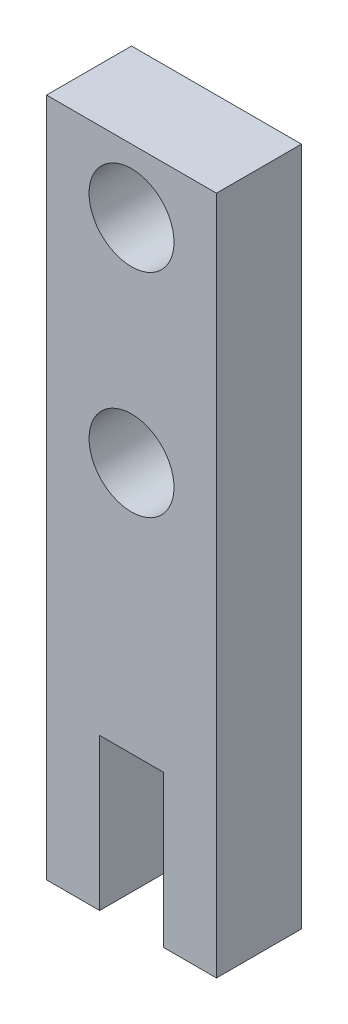
ISO-10303-21;
HEADER;
FILE_DESCRIPTION(('STEP AP214'),'2;1');
FILE_NAME('part.step','',(''),(''),'','','');
FILE_SCHEMA(('AUTOMOTIVE_DESIGN { 1 0 10303 214 1 1 1 1 }'));
ENDSEC;
DATA;
#1=APPLICATION_CONTEXT('core data for automotive mechanical design processes');
#2=APPLICATION_PROTOCOL_DEFINITION('international standard','automotive_design',2000,#1);
#3=PRODUCT_CONTEXT('',#1,'mechanical');
#4=PRODUCT('Part','Part','',(#3));
#5=PRODUCT_RELATED_PRODUCT_CATEGORY('part','',(#4));
#6=PRODUCT_DEFINITION_FORMATION('','',#4);
#7=PRODUCT_DEFINITION_CONTEXT('part definition',#1,'design');
#8=PRODUCT_DEFINITION('design','',#6,#7);
#9=PRODUCT_DEFINITION_SHAPE('','',#8);
#10=(LENGTH_UNIT() NAMED_UNIT(*) SI_UNIT(.MILLI.,.METRE.));
#11=(NAMED_UNIT(*) PLANE_ANGLE_UNIT() SI_UNIT($,.RADIAN.));
#12=(NAMED_UNIT(*) SI_UNIT($,.STERADIAN.) SOLID_ANGLE_UNIT());
#13=UNCERTAINTY_MEASURE_WITH_UNIT(LENGTH_MEASURE(1.E-05),#10,'distance_accuracy_value','');
#14=(GEOMETRIC_REPRESENTATION_CONTEXT(3) GLOBAL_UNCERTAINTY_ASSIGNED_CONTEXT((#13)) GLOBAL_UNIT_ASSIGNED_CONTEXT((#10,
#11,#12)) REPRESENTATION_CONTEXT('',''));
#15=CARTESIAN_POINT('',(0.,0.,0.));
#16=DIRECTION('',(0.,0.,1.));
#17=DIRECTION('',(1.,0.,0.));
#18=AXIS2_PLACEMENT_3D('',#15,#16,#17);
#19=CARTESIAN_POINT('',(0.,0.,25.4));
#20=DIRECTION('',(0.,1.,0.));
#21=DIRECTION('',(0.,0.,1.));
#22=AXIS2_PLACEMENT_3D('',#19,#20,#21);
#23=PLANE('',#22);
#24=DIRECTION('',(1.,0.,0.));
#25=VECTOR('',#24,1.);
#26=CARTESIAN_POINT('',(0.,0.,25.4));
#27=LINE('',#26,#25);
#28=CARTESIAN_POINT('',(34.925,0.,25.4));
#29=VERTEX_POINT('',#28);
#30=CARTESIAN_POINT('',(50.8,0.,25.4));
#31=VERTEX_POINT('',#30);
#32=EDGE_CURVE('E179',#29,#31,#27,.T.);
#33=ORIENTED_EDGE('',*,*,#32,.F.);
#34=DIRECTION('',(0.,0.,1.));
#35=VECTOR('',#34,1.);
#36=CARTESIAN_POINT('',(34.925,0.,0.));
#37=LINE('',#36,#35);
#38=CARTESIAN_POINT('',(34.925,0.,0.));
#39=VERTEX_POINT('',#38);
#40=EDGE_CURVE('E151',#39,#29,#37,.T.);
#41=ORIENTED_EDGE('',*,*,#40,.F.);
#42=DIRECTION('',(1.,0.,0.));
#43=VECTOR('',#42,1.);
#44=CARTESIAN_POINT('',(0.,0.,0.));
#45=LINE('',#44,#43);
#46=CARTESIAN_POINT('',(50.8,0.,0.));
#47=VERTEX_POINT('',#46);
#48=EDGE_CURVE('E137',#39,#47,#45,.T.);
#49=ORIENTED_EDGE('',*,*,#48,.T.);
#50=DIRECTION('',(0.,0.,-1.));
#51=VECTOR('',#50,1.);
#52=CARTESIAN_POINT('',(50.8,0.,25.4));
#53=LINE('',#52,#51);
#54=EDGE_CURVE('E47',#31,#47,#53,.T.);
#55=ORIENTED_EDGE('',*,*,#54,.F.);
#56=EDGE_LOOP('',(#33,#41,#49,#55));
#57=FACE_BOUND('',#56,.T.);
#58=ADVANCED_FACE('F38',(#57),#23,.F.);
#59=CARTESIAN_POINT('',(0.,0.,25.4));
#60=DIRECTION('',(1.,0.,0.));
#61=DIRECTION('',(0.,0.,-1.));
#62=AXIS2_PLACEMENT_3D('',#59,#60,#61);
#63=PLANE('',#62);
#64=DIRECTION('',(0.,-1.,0.));
#65=VECTOR('',#64,1.);
#66=CARTESIAN_POINT('',(0.,0.,0.));
#67=LINE('',#66,#65);
#68=CARTESIAN_POINT('',(0.,203.2,0.));
#69=VERTEX_POINT('',#68);
#70=CARTESIAN_POINT('',(0.,0.,0.));
#71=VERTEX_POINT('',#70);
#72=EDGE_CURVE('E175',#69,#71,#67,.T.);
#73=ORIENTED_EDGE('',*,*,#72,.T.);
#74=DIRECTION('',(0.,0.,-1.));
#75=VECTOR('',#74,1.);
#76=CARTESIAN_POINT('',(0.,0.,25.4));
#77=LINE('',#76,#75);
#78=CARTESIAN_POINT('',(0.,0.,25.4));
#79=VERTEX_POINT('',#78);
#80=EDGE_CURVE('E11',#79,#71,#77,.T.);
#81=ORIENTED_EDGE('',*,*,#80,.F.);
#82=DIRECTION('',(0.,-1.,0.));
#83=VECTOR('',#82,1.);
#84=CARTESIAN_POINT('',(0.,0.,25.4));
#85=LINE('',#84,#83);
#86=CARTESIAN_POINT('',(0.,203.2,25.4));
#87=VERTEX_POINT('',#86);
#88=EDGE_CURVE('E176',#87,#79,#85,.T.);
#89=ORIENTED_EDGE('',*,*,#88,.F.);
#90=DIRECTION('',(0.,0.,-1.));
#91=VECTOR('',#90,1.);
#92=CARTESIAN_POINT('',(0.,203.2,25.4));
#93=LINE('',#92,#91);
#94=EDGE_CURVE('E187',#87,#69,#93,.T.);
#95=ORIENTED_EDGE('',*,*,#94,.T.);
#96=EDGE_LOOP('',(#73,#81,#89,#95));
#97=FACE_BOUND('',#96,.T.);
#98=ADVANCED_FACE('F40',(#97),#63,.F.);
#99=CARTESIAN_POINT('',(15.875,0.,0.));
#100=VERTEX_POINT('',#99);
#101=EDGE_CURVE('E191',#71,#100,#45,.T.);
#102=ORIENTED_EDGE('',*,*,#101,.T.);
#103=DIRECTION('',(0.,0.,1.));
#104=VECTOR('',#103,1.);
#105=CARTESIAN_POINT('',(15.875,0.,0.));
#106=LINE('',#105,#104);
#107=CARTESIAN_POINT('',(15.875,0.,25.4));
#108=VERTEX_POINT('',#107);
#109=EDGE_CURVE('E155',#100,#108,#106,.T.);
#110=ORIENTED_EDGE('',*,*,#109,.T.);
#111=EDGE_CURVE('E91',#79,#108,#27,.T.);
#112=ORIENTED_EDGE('',*,*,#111,.F.);
#113=ORIENTED_EDGE('',*,*,#80,.T.);
#114=EDGE_LOOP('',(#102,#110,#112,#113));
#115=FACE_BOUND('',#114,.T.);
#116=ADVANCED_FACE('F227',(#115),#23,.F.);
#117=CARTESIAN_POINT('',(50.8,0.,25.4));
#118=DIRECTION('',(-1.,0.,0.));
#119=DIRECTION('',(0.,0.,1.));
#120=AXIS2_PLACEMENT_3D('',#117,#118,#119);
#121=PLANE('',#120);
#122=DIRECTION('',(0.,1.,0.));
#123=VECTOR('',#122,1.);
#124=CARTESIAN_POINT('',(50.8,0.,0.));
#125=LINE('',#124,#123);
#126=CARTESIAN_POINT('',(50.8,203.2,0.));
#127=VERTEX_POINT('',#126);
#128=EDGE_CURVE('E195',#47,#127,#125,.T.);
#129=ORIENTED_EDGE('',*,*,#128,.T.);
#130=DIRECTION('',(0.,0.,-1.));
#131=VECTOR('',#130,1.);
#132=CARTESIAN_POINT('',(50.8,203.2,25.4));
#133=LINE('',#132,#131);
#134=CARTESIAN_POINT('',(50.8,203.2,25.4));
#135=VERTEX_POINT('',#134);
#136=EDGE_CURVE('E202',#135,#127,#133,.T.);
#137=ORIENTED_EDGE('',*,*,#136,.F.);
#138=DIRECTION('',(0.,1.,0.));
#139=VECTOR('',#138,1.);
#140=CARTESIAN_POINT('',(50.8,0.,25.4));
#141=LINE('',#140,#139);
#142=EDGE_CURVE('E182',#31,#135,#141,.T.);
#143=ORIENTED_EDGE('',*,*,#142,.F.);
#144=ORIENTED_EDGE('',*,*,#54,.T.);
#145=EDGE_LOOP('',(#129,#137,#143,#144));
#146=FACE_BOUND('',#145,.T.);
#147=ADVANCED_FACE('F209',(#146),#121,.F.);
#148=CARTESIAN_POINT('',(0.,203.2,25.4));
#149=DIRECTION('',(0.,-1.,0.));
#150=DIRECTION('',(0.,0.,-1.));
#151=AXIS2_PLACEMENT_3D('',#148,#149,#150);
#152=PLANE('',#151);
#153=DIRECTION('',(-1.,0.,0.));
#154=VECTOR('',#153,1.);
#155=CARTESIAN_POINT('',(0.,203.2,0.));
#156=LINE('',#155,#154);
#157=EDGE_CURVE('E84',#127,#69,#156,.T.);
#158=ORIENTED_EDGE('',*,*,#157,.T.);
#159=ORIENTED_EDGE('',*,*,#94,.F.);
#160=DIRECTION('',(-1.,0.,0.));
#161=VECTOR('',#160,1.);
#162=CARTESIAN_POINT('',(0.,203.2,25.4));
#163=LINE('',#162,#161);
#164=EDGE_CURVE('E63',#135,#87,#163,.T.);
#165=ORIENTED_EDGE('',*,*,#164,.F.);
#166=ORIENTED_EDGE('',*,*,#136,.T.);
#167=EDGE_LOOP('',(#158,#159,#165,#166));
#168=FACE_BOUND('',#167,.T.);
#169=ADVANCED_FACE('F217',(#168),#152,.F.);
#170=CARTESIAN_POINT('',(0.,0.,25.4));
#171=DIRECTION('',(0.,0.,-1.));
#172=DIRECTION('',(-1.,0.,0.));
#173=AXIS2_PLACEMENT_3D('',#170,#171,#172);
#174=PLANE('',#173);
#175=CARTESIAN_POINT('',(25.4,184.15,25.4));
#176=DIRECTION('',(0.,0.,-1.));
#177=DIRECTION('',(-1.,0.,0.));
#178=AXIS2_PLACEMENT_3D('',#175,#176,#177);
#179=CIRCLE('',#178,12.7);
#180=CARTESIAN_POINT('',(12.7,184.15,25.4));
#181=VERTEX_POINT('',#180);
#182=EDGE_CURVE('E171',#181,#181,#179,.T.);
#183=ORIENTED_EDGE('',*,*,#182,.T.);
#184=EDGE_LOOP('',(#183));
#185=FACE_BOUND('',#184,.T.);
#186=CARTESIAN_POINT('',(25.4,120.65,25.4));
#187=DIRECTION('',(0.,0.,-1.));
#188=DIRECTION('',(-1.,0.,0.));
#189=AXIS2_PLACEMENT_3D('',#186,#187,#188);
#190=CIRCLE('',#189,12.7);
#191=CARTESIAN_POINT('',(12.7,120.65,25.4));
#192=VERTEX_POINT('',#191);
#193=EDGE_CURVE('E164',#192,#192,#190,.T.);
#194=ORIENTED_EDGE('',*,*,#193,.T.);
#195=EDGE_LOOP('',(#194));
#196=FACE_BOUND('',#195,.T.);
#197=DIRECTION('',(-1.,0.,0.));
#198=VECTOR('',#197,1.);
#199=CARTESIAN_POINT('',(34.925,45.3498232276186,25.4));
#200=LINE('',#199,#198);
#201=CARTESIAN_POINT('',(34.925,45.3498232276186,25.4));
#202=VERTEX_POINT('',#201);
#203=CARTESIAN_POINT('',(15.875,45.3498232276186,25.4));
#204=VERTEX_POINT('',#203);
#205=EDGE_CURVE('E142',#202,#204,#200,.T.);
#206=ORIENTED_EDGE('',*,*,#205,.F.);
#207=DIRECTION('',(0.,1.,0.));
#208=VECTOR('',#207,1.);
#209=CARTESIAN_POINT('',(34.925,0.,25.4));
#210=LINE('',#209,#208);
#211=EDGE_CURVE('E120',#29,#202,#210,.T.);
#212=ORIENTED_EDGE('',*,*,#211,.F.);
#213=ORIENTED_EDGE('',*,*,#32,.T.);
#214=ORIENTED_EDGE('',*,*,#142,.T.);
#215=ORIENTED_EDGE('',*,*,#164,.T.);
#216=ORIENTED_EDGE('',*,*,#88,.T.);
#217=ORIENTED_EDGE('',*,*,#111,.T.);
#218=DIRECTION('',(0.,-1.,0.));
#219=VECTOR('',#218,1.);
#220=CARTESIAN_POINT('',(15.875,0.,25.4));
#221=LINE('',#220,#219);
#222=EDGE_CURVE('E139',#204,#108,#221,.T.);
#223=ORIENTED_EDGE('',*,*,#222,.F.);
#224=EDGE_LOOP('',(#206,#212,#213,#214,#215,#216,#217,#223));
#225=FACE_BOUND('',#224,.T.);
#226=ADVANCED_FACE('F219',(#185,#196,#225),#174,.F.);
#227=CARTESIAN_POINT('',(0.,0.,0.));
#228=DIRECTION('',(0.,0.,-1.));
#229=DIRECTION('',(-1.,0.,0.));
#230=AXIS2_PLACEMENT_3D('',#227,#228,#229);
#231=PLANE('',#230);
#232=DIRECTION('',(0.,1.,0.));
#233=VECTOR('',#232,1.);
#234=CARTESIAN_POINT('',(34.925,0.,0.));
#235=LINE('',#234,#233);
#236=CARTESIAN_POINT('',(34.925,45.3498232276186,0.));
#237=VERTEX_POINT('',#236);
#238=EDGE_CURVE('E117',#39,#237,#235,.T.);
#239=ORIENTED_EDGE('',*,*,#238,.T.);
#240=DIRECTION('',(-1.,0.,0.));
#241=VECTOR('',#240,1.);
#242=CARTESIAN_POINT('',(34.925,45.3498232276186,0.));
#243=LINE('',#242,#241);
#244=CARTESIAN_POINT('',(15.875,45.3498232276186,0.));
#245=VERTEX_POINT('',#244);
#246=EDGE_CURVE('E128',#237,#245,#243,.T.);
#247=ORIENTED_EDGE('',*,*,#246,.T.);
#248=DIRECTION('',(0.,-1.,0.));
#249=VECTOR('',#248,1.);
#250=CARTESIAN_POINT('',(15.875,0.,0.));
#251=LINE('',#250,#249);
#252=EDGE_CURVE('E54',#245,#100,#251,.T.);
#253=ORIENTED_EDGE('',*,*,#252,.T.);
#254=ORIENTED_EDGE('',*,*,#101,.F.);
#255=ORIENTED_EDGE('',*,*,#72,.F.);
#256=ORIENTED_EDGE('',*,*,#157,.F.);
#257=ORIENTED_EDGE('',*,*,#128,.F.);
#258=ORIENTED_EDGE('',*,*,#48,.F.);
#259=EDGE_LOOP('',(#239,#247,#253,#254,#255,#256,#257,#258));
#260=FACE_BOUND('',#259,.T.);
#261=CARTESIAN_POINT('',(25.4,184.15,0.));
#262=DIRECTION('',(0.,0.,1.));
#263=DIRECTION('',(1.,0.,0.));
#264=AXIS2_PLACEMENT_3D('',#261,#262,#263);
#265=CIRCLE('',#264,12.7);
#266=CARTESIAN_POINT('',(38.1,184.15,0.));
#267=VERTEX_POINT('',#266);
#268=EDGE_CURVE('E160',#267,#267,#265,.T.);
#269=ORIENTED_EDGE('',*,*,#268,.T.);
#270=EDGE_LOOP('',(#269));
#271=FACE_BOUND('',#270,.T.);
#272=CARTESIAN_POINT('',(25.4,120.65,0.));
#273=DIRECTION('',(0.,0.,1.));
#274=DIRECTION('',(1.,0.,0.));
#275=AXIS2_PLACEMENT_3D('',#272,#273,#274);
#276=CIRCLE('',#275,12.7);
#277=CARTESIAN_POINT('',(38.1,120.65,0.));
#278=VERTEX_POINT('',#277);
#279=EDGE_CURVE('E154',#278,#278,#276,.T.);
#280=ORIENTED_EDGE('',*,*,#279,.T.);
#281=EDGE_LOOP('',(#280));
#282=FACE_BOUND('',#281,.T.);
#283=ADVANCED_FACE('F134',(#260,#271,#282),#231,.T.);
#284=CARTESIAN_POINT('',(25.4,120.65,0.));
#285=DIRECTION('',(0.,0.,1.));
#286=DIRECTION('',(1.,0.,0.));
#287=AXIS2_PLACEMENT_3D('',#284,#285,#286);
#288=CYLINDRICAL_SURFACE('',#287,12.7);
#289=ORIENTED_EDGE('',*,*,#279,.F.);
#290=EDGE_LOOP('',(#289));
#291=FACE_BOUND('',#290,.T.);
#292=ORIENTED_EDGE('',*,*,#193,.F.);
#293=EDGE_LOOP('',(#292));
#294=FACE_BOUND('',#293,.T.);
#295=ADVANCED_FACE('F251',(#291,#294),#288,.F.);
#296=CARTESIAN_POINT('',(25.4,184.15,0.));
#297=DIRECTION('',(0.,0.,1.));
#298=DIRECTION('',(1.,0.,0.));
#299=AXIS2_PLACEMENT_3D('',#296,#297,#298);
#300=CYLINDRICAL_SURFACE('',#299,12.7);
#301=ORIENTED_EDGE('',*,*,#268,.F.);
#302=EDGE_LOOP('',(#301));
#303=FACE_BOUND('',#302,.T.);
#304=ORIENTED_EDGE('',*,*,#182,.F.);
#305=EDGE_LOOP('',(#304));
#306=FACE_BOUND('',#305,.T.);
#307=ADVANCED_FACE('F246',(#303,#306),#300,.F.);
#308=CARTESIAN_POINT('',(34.925,0.,0.));
#309=DIRECTION('',(1.,0.,0.));
#310=DIRECTION('',(0.,0.,-1.));
#311=AXIS2_PLACEMENT_3D('',#308,#309,#310);
#312=PLANE('',#311);
#313=ORIENTED_EDGE('',*,*,#211,.T.);
#314=DIRECTION('',(0.,0.,1.));
#315=VECTOR('',#314,1.);
#316=CARTESIAN_POINT('',(34.925,45.3498232276186,0.));
#317=LINE('',#316,#315);
#318=EDGE_CURVE('E113',#237,#202,#317,.T.);
#319=ORIENTED_EDGE('',*,*,#318,.F.);
#320=ORIENTED_EDGE('',*,*,#238,.F.);
#321=ORIENTED_EDGE('',*,*,#40,.T.);
#322=EDGE_LOOP('',(#313,#319,#320,#321));
#323=FACE_BOUND('',#322,.T.);
#324=ADVANCED_FACE('F115',(#323),#312,.F.);
#325=CARTESIAN_POINT('',(15.875,0.,0.));
#326=DIRECTION('',(-1.,0.,0.));
#327=DIRECTION('',(0.,0.,1.));
#328=AXIS2_PLACEMENT_3D('',#325,#326,#327);
#329=PLANE('',#328);
#330=ORIENTED_EDGE('',*,*,#222,.T.);
#331=ORIENTED_EDGE('',*,*,#109,.F.);
#332=ORIENTED_EDGE('',*,*,#252,.F.);
#333=DIRECTION('',(0.,0.,1.));
#334=VECTOR('',#333,1.);
#335=CARTESIAN_POINT('',(15.875,45.3498232276186,0.));
#336=LINE('',#335,#334);
#337=EDGE_CURVE('E125',#245,#204,#336,.T.);
#338=ORIENTED_EDGE('',*,*,#337,.T.);
#339=EDGE_LOOP('',(#330,#331,#332,#338));
#340=FACE_BOUND('',#339,.T.);
#341=ADVANCED_FACE('F238',(#340),#329,.F.);
#342=CARTESIAN_POINT('',(34.925,45.3498232276186,0.));
#343=DIRECTION('',(0.,1.,0.));
#344=DIRECTION('',(-1.,0.,0.));
#345=AXIS2_PLACEMENT_3D('',#342,#343,#344);
#346=PLANE('',#345);
#347=ORIENTED_EDGE('',*,*,#205,.T.);
#348=ORIENTED_EDGE('',*,*,#337,.F.);
#349=ORIENTED_EDGE('',*,*,#246,.F.);
#350=ORIENTED_EDGE('',*,*,#318,.T.);
#351=EDGE_LOOP('',(#347,#348,#349,#350));
#352=FACE_BOUND('',#351,.T.);
#353=ADVANCED_FACE('F129',(#352),#346,.F.);
#354=CLOSED_SHELL('',(#58,#98,#116,#147,#169,#226,#283,#295,#307,#324,#341,#353));
#355=MANIFOLD_SOLID_BREP('B2',#354);
#356=ADVANCED_BREP_SHAPE_REPRESENTATION('',(#18,#355),#14);
#357=SHAPE_DEFINITION_REPRESENTATION(#9,#356);
ENDSEC;
END-ISO-10303-21;
